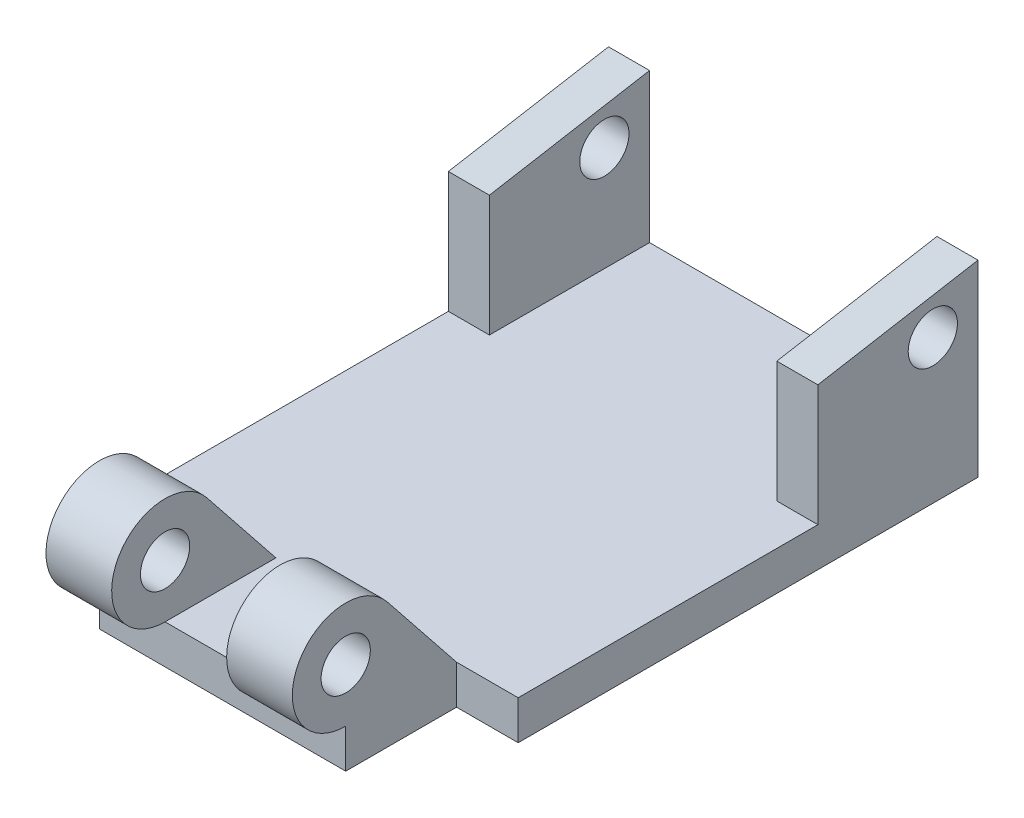
ISO-10303-21;
HEADER;
FILE_DESCRIPTION(('STEP AP214'),'2;1');
FILE_NAME('part.step','',(''),(''),'','','');
FILE_SCHEMA(('AUTOMOTIVE_DESIGN { 1 0 10303 214 1 1 1 1 }'));
ENDSEC;
DATA;
#1=APPLICATION_CONTEXT('core data for automotive mechanical design processes');
#2=APPLICATION_PROTOCOL_DEFINITION('international standard','automotive_design',2000,#1);
#3=PRODUCT_CONTEXT('',#1,'mechanical');
#4=PRODUCT('Part','Part','',(#3));
#5=PRODUCT_RELATED_PRODUCT_CATEGORY('part','',(#4));
#6=PRODUCT_DEFINITION_FORMATION('','',#4);
#7=PRODUCT_DEFINITION_CONTEXT('part definition',#1,'design');
#8=PRODUCT_DEFINITION('design','',#6,#7);
#9=PRODUCT_DEFINITION_SHAPE('','',#8);
#10=(LENGTH_UNIT() NAMED_UNIT(*) SI_UNIT(.MILLI.,.METRE.));
#11=(NAMED_UNIT(*) PLANE_ANGLE_UNIT() SI_UNIT($,.RADIAN.));
#12=(NAMED_UNIT(*) SI_UNIT($,.STERADIAN.) SOLID_ANGLE_UNIT());
#13=UNCERTAINTY_MEASURE_WITH_UNIT(LENGTH_MEASURE(1.E-05),#10,'distance_accuracy_value','');
#14=(GEOMETRIC_REPRESENTATION_CONTEXT(3) GLOBAL_UNCERTAINTY_ASSIGNED_CONTEXT((#13)) GLOBAL_UNIT_ASSIGNED_CONTEXT((#10,
#11,#12)) REPRESENTATION_CONTEXT('',''));
#15=CARTESIAN_POINT('',(0.,0.,0.));
#16=DIRECTION('',(0.,0.,1.));
#17=DIRECTION('',(1.,0.,0.));
#18=AXIS2_PLACEMENT_3D('',#15,#16,#17);
#19=CARTESIAN_POINT('',(0.,6.0325,-71.12));
#20=DIRECTION('',(0.,0.,-1.));
#21=DIRECTION('',(-1.,0.,0.));
#22=AXIS2_PLACEMENT_3D('',#19,#20,#21);
#23=PLANE('',#22);
#24=DIRECTION('',(-1.,0.,0.));
#25=VECTOR('',#24,1.);
#26=CARTESIAN_POINT('',(0.,6.0325,-71.12));
#27=LINE('',#26,#25);
#28=CARTESIAN_POINT('',(50.8,6.0325,-71.12));
#29=VERTEX_POINT('',#28);
#30=CARTESIAN_POINT('',(6.35,6.0325,-71.12));
#31=VERTEX_POINT('',#30);
#32=EDGE_CURVE('E179',#29,#31,#27,.T.);
#33=ORIENTED_EDGE('',*,*,#32,.F.);
#34=DIRECTION('',(0.,1.,0.));
#35=VECTOR('',#34,1.);
#36=CARTESIAN_POINT('',(50.8,0.,-71.12));
#37=LINE('',#36,#35);
#38=CARTESIAN_POINT('',(50.8,29.083,-71.12));
#39=VERTEX_POINT('',#38);
#40=EDGE_CURVE('E176',#29,#39,#37,.T.);
#41=ORIENTED_EDGE('',*,*,#40,.T.);
#42=DIRECTION('',(-1.,0.,0.));
#43=VECTOR('',#42,1.);
#44=CARTESIAN_POINT('',(90.9823923961933,29.083,-71.12));
#45=LINE('',#44,#43);
#46=CARTESIAN_POINT('',(57.15,29.083,-71.12));
#47=VERTEX_POINT('',#46);
#48=EDGE_CURVE('E219',#47,#39,#45,.T.);
#49=ORIENTED_EDGE('',*,*,#48,.F.);
#50=DIRECTION('',(0.,-1.,0.));
#51=VECTOR('',#50,1.);
#52=CARTESIAN_POINT('',(57.15,6.0325,-71.12));
#53=LINE('',#52,#51);
#54=CARTESIAN_POINT('',(57.15,0.,-71.12));
#55=VERTEX_POINT('',#54);
#56=EDGE_CURVE('E354',#47,#55,#53,.T.);
#57=ORIENTED_EDGE('',*,*,#56,.T.);
#58=DIRECTION('',(1.,0.,0.));
#59=VECTOR('',#58,1.);
#60=CARTESIAN_POINT('',(0.,0.,-71.12));
#61=LINE('',#60,#59);
#62=CARTESIAN_POINT('',(0.,0.,-71.12));
#63=VERTEX_POINT('',#62);
#64=EDGE_CURVE('E342',#63,#55,#61,.T.);
#65=ORIENTED_EDGE('',*,*,#64,.F.);
#66=DIRECTION('',(0.,-1.,0.));
#67=VECTOR('',#66,1.);
#68=CARTESIAN_POINT('',(0.,6.0325,-71.12));
#69=LINE('',#68,#67);
#70=CARTESIAN_POINT('',(0.,29.083,-71.12));
#71=VERTEX_POINT('',#70);
#72=EDGE_CURVE('E351',#71,#63,#69,.T.);
#73=ORIENTED_EDGE('',*,*,#72,.F.);
#74=CARTESIAN_POINT('',(6.35000000000001,29.083,-71.12));
#75=VERTEX_POINT('',#74);
#76=EDGE_CURVE('E189',#75,#71,#45,.T.);
#77=ORIENTED_EDGE('',*,*,#76,.F.);
#78=DIRECTION('',(0.,1.,0.));
#79=VECTOR('',#78,1.);
#80=CARTESIAN_POINT('',(6.35,0.,-71.12));
#81=LINE('',#80,#79);
#82=EDGE_CURVE('E59',#31,#75,#81,.T.);
#83=ORIENTED_EDGE('',*,*,#82,.F.);
#84=EDGE_LOOP('',(#33,#41,#49,#57,#65,#73,#77,#83));
#85=FACE_BOUND('',#84,.T.);
#86=ADVANCED_FACE('F41',(#85),#23,.T.);
#87=CARTESIAN_POINT('',(90.9823923961933,6.0325,-46.355));
#88=DIRECTION('',(0.,0.,1.));
#89=DIRECTION('',(1.,0.,0.));
#90=AXIS2_PLACEMENT_3D('',#87,#88,#89);
#91=PLANE('',#90);
#92=DIRECTION('',(-1.,0.,0.));
#93=VECTOR('',#92,1.);
#94=CARTESIAN_POINT('',(90.9823923961933,24.765,-46.355));
#95=LINE('',#94,#93);
#96=CARTESIAN_POINT('',(57.15,24.765,-46.355));
#97=VERTEX_POINT('',#96);
#98=CARTESIAN_POINT('',(50.8,24.765,-46.355));
#99=VERTEX_POINT('',#98);
#100=EDGE_CURVE('E235',#97,#99,#95,.T.);
#101=ORIENTED_EDGE('',*,*,#100,.T.);
#102=DIRECTION('',(0.,-1.,0.));
#103=VECTOR('',#102,1.);
#104=CARTESIAN_POINT('',(50.8,6.0325,-46.355));
#105=LINE('',#104,#103);
#106=CARTESIAN_POINT('',(50.8,6.0325,-46.355));
#107=VERTEX_POINT('',#106);
#108=EDGE_CURVE('E207',#99,#107,#105,.T.);
#109=ORIENTED_EDGE('',*,*,#108,.T.);
#110=DIRECTION('',(-1.,0.,0.));
#111=VECTOR('',#110,1.);
#112=CARTESIAN_POINT('',(90.9823923961933,6.0325,-46.355));
#113=LINE('',#112,#111);
#114=CARTESIAN_POINT('',(57.15,6.0325,-46.355));
#115=VERTEX_POINT('',#114);
#116=EDGE_CURVE('E240',#115,#107,#113,.T.);
#117=ORIENTED_EDGE('',*,*,#116,.F.);
#118=DIRECTION('',(0.,-1.,0.));
#119=VECTOR('',#118,1.);
#120=CARTESIAN_POINT('',(57.15,6.0325,-46.355));
#121=LINE('',#120,#119);
#122=EDGE_CURVE('E212',#97,#115,#121,.T.);
#123=ORIENTED_EDGE('',*,*,#122,.F.);
#124=EDGE_LOOP('',(#101,#109,#117,#123));
#125=FACE_BOUND('',#124,.T.);
#126=ADVANCED_FACE('F391',(#125),#91,.T.);
#127=CARTESIAN_POINT('',(90.9823923961933,24.765,-46.355));
#128=DIRECTION('',(0.,0.985137504933579,0.171767564962778));
#129=DIRECTION('',(0.,-0.171767564962778,0.985137504933579));
#130=AXIS2_PLACEMENT_3D('',#127,#128,#129);
#131=PLANE('',#130);
#132=ORIENTED_EDGE('',*,*,#48,.T.);
#133=DIRECTION('',(0.,-0.171767564962778,0.985137504933579));
#134=VECTOR('',#133,1.);
#135=CARTESIAN_POINT('',(50.8,24.765,-46.355));
#136=LINE('',#135,#134);
#137=EDGE_CURVE('E203',#39,#99,#136,.T.);
#138=ORIENTED_EDGE('',*,*,#137,.T.);
#139=ORIENTED_EDGE('',*,*,#100,.F.);
#140=DIRECTION('',(0.,-0.171767564962778,0.985137504933579));
#141=VECTOR('',#140,1.);
#142=CARTESIAN_POINT('',(57.15,24.765,-46.355));
#143=LINE('',#142,#141);
#144=EDGE_CURVE('E216',#47,#97,#143,.T.);
#145=ORIENTED_EDGE('',*,*,#144,.F.);
#146=EDGE_LOOP('',(#132,#138,#139,#145));
#147=FACE_BOUND('',#146,.T.);
#148=ADVANCED_FACE('F396',(#147),#131,.T.);
#149=CARTESIAN_POINT('',(90.9823923961933,22.225,-64.135));
#150=DIRECTION('',(-1.,0.,0.));
#151=DIRECTION('',(0.,0.,1.));
#152=AXIS2_PLACEMENT_3D('',#149,#150,#151);
#153=CYLINDRICAL_SURFACE('',#152,3.81);
#154=CARTESIAN_POINT('',(57.15,22.225,-64.135));
#155=DIRECTION('',(-1.,0.,0.));
#156=DIRECTION('',(0.,0.,1.));
#157=AXIS2_PLACEMENT_3D('',#154,#155,#156);
#158=CIRCLE('',#157,3.81);
#159=CARTESIAN_POINT('',(57.15,22.225,-60.325));
#160=VERTEX_POINT('',#159);
#161=EDGE_CURVE('E215',#160,#160,#158,.F.);
#162=ORIENTED_EDGE('',*,*,#161,.T.);
#163=EDGE_LOOP('',(#162));
#164=FACE_BOUND('',#163,.T.);
#165=CARTESIAN_POINT('',(50.8,22.225,-64.135));
#166=DIRECTION('',(-1.,0.,0.));
#167=DIRECTION('',(0.,0.,1.));
#168=AXIS2_PLACEMENT_3D('',#165,#166,#167);
#169=CIRCLE('',#168,3.81);
#170=CARTESIAN_POINT('',(50.8,22.225,-60.325));
#171=VERTEX_POINT('',#170);
#172=EDGE_CURVE('E45',#171,#171,#169,.F.);
#173=ORIENTED_EDGE('',*,*,#172,.F.);
#174=EDGE_LOOP('',(#173));
#175=FACE_BOUND('',#174,.T.);
#176=ADVANCED_FACE('F479',(#164,#175),#153,.F.);
#177=CARTESIAN_POINT('',(77.9192255223665,2.34596058551297,-2.94082916255377));
#178=DIRECTION('',(0.,-0.623608017817372,0.78173719376392));
#179=DIRECTION('',(0.,-0.78173719376392,-0.623608017817372));
#180=AXIS2_PLACEMENT_3D('',#177,#178,#179);
#181=PLANE('',#180);
#182=DIRECTION('',(0.,0.78173719376392,0.623608017817372));
#183=VECTOR('',#182,1.);
#184=CARTESIAN_POINT('',(19.685,2.34596058551297,-2.94082916255376));
#185=LINE('',#184,#183);
#186=CARTESIAN_POINT('',(19.685,6.0325,0.));
#187=VERTEX_POINT('',#186);
#188=CARTESIAN_POINT('',(19.685,19.4353841870824,10.6917594654789));
#189=VERTEX_POINT('',#188);
#190=EDGE_CURVE('E264',#187,#189,#185,.T.);
#191=ORIENTED_EDGE('',*,*,#190,.F.);
#192=DIRECTION('',(-1.,0.,0.));
#193=VECTOR('',#192,1.);
#194=CARTESIAN_POINT('',(77.9192255223665,6.0325,0.));
#195=LINE('',#194,#193);
#196=CARTESIAN_POINT('',(9.525,6.0325,0.));
#197=VERTEX_POINT('',#196);
#198=EDGE_CURVE('E268',#187,#197,#195,.T.);
#199=ORIENTED_EDGE('',*,*,#198,.T.);
#200=DIRECTION('',(0.,0.78173719376392,0.623608017817372));
#201=VECTOR('',#200,1.);
#202=CARTESIAN_POINT('',(9.525,2.34596058551297,-2.94082916255376));
#203=LINE('',#202,#201);
#204=CARTESIAN_POINT('',(9.525,19.4353841870824,10.6917594654789));
#205=VERTEX_POINT('',#204);
#206=EDGE_CURVE('E275',#197,#205,#203,.T.);
#207=ORIENTED_EDGE('',*,*,#206,.T.);
#208=DIRECTION('',(-1.,0.,0.));
#209=VECTOR('',#208,1.);
#210=CARTESIAN_POINT('',(77.9192255223665,19.4353841870824,10.6917594654788));
#211=LINE('',#210,#209);
#212=EDGE_CURVE('E292',#189,#205,#211,.T.);
#213=ORIENTED_EDGE('',*,*,#212,.F.);
#214=EDGE_LOOP('',(#191,#199,#207,#213));
#215=FACE_BOUND('',#214,.T.);
#216=ADVANCED_FACE('F481',(#215),#181,.F.);
#217=CARTESIAN_POINT('',(77.9192255223665,14.2875,17.145));
#218=DIRECTION('',(-1.,0.,0.));
#219=DIRECTION('',(0.,0.,1.));
#220=AXIS2_PLACEMENT_3D('',#217,#218,#219);
#221=CYLINDRICAL_SURFACE('',#220,8.255);
#222=DIRECTION('',(1.,0.,0.));
#223=VECTOR('',#222,1.);
#224=CARTESIAN_POINT('',(0.,6.0325,17.145));
#225=LINE('',#224,#223);
#226=CARTESIAN_POINT('',(9.525,6.0325,17.145));
#227=VERTEX_POINT('',#226);
#228=CARTESIAN_POINT('',(19.685,6.0325,17.145));
#229=VERTEX_POINT('',#228);
#230=EDGE_CURVE('E309',#227,#229,#225,.T.);
#231=ORIENTED_EDGE('',*,*,#230,.T.);
#232=CARTESIAN_POINT('',(19.685,14.2875,17.145));
#233=DIRECTION('',(1.,0.,0.));
#234=DIRECTION('',(0.,0.,-1.));
#235=AXIS2_PLACEMENT_3D('',#232,#233,#234);
#236=CIRCLE('',#235,8.255);
#237=EDGE_CURVE('E261',#229,#189,#236,.F.);
#238=ORIENTED_EDGE('',*,*,#237,.T.);
#239=ORIENTED_EDGE('',*,*,#212,.T.);
#240=CARTESIAN_POINT('',(9.525,14.2875,17.145));
#241=DIRECTION('',(-1.,0.,0.));
#242=DIRECTION('',(0.,0.,1.));
#243=AXIS2_PLACEMENT_3D('',#240,#241,#242);
#244=CIRCLE('',#243,8.255);
#245=EDGE_CURVE('E273',#227,#205,#244,.T.);
#246=ORIENTED_EDGE('',*,*,#245,.F.);
#247=EDGE_LOOP('',(#231,#238,#239,#246));
#248=FACE_BOUND('',#247,.T.);
#249=ADVANCED_FACE('F487',(#248),#221,.T.);
#250=CARTESIAN_POINT('',(77.9192255223665,14.2875,17.145));
#251=DIRECTION('',(-1.,0.,0.));
#252=DIRECTION('',(0.,0.,1.));
#253=AXIS2_PLACEMENT_3D('',#250,#251,#252);
#254=CYLINDRICAL_SURFACE('',#253,3.81);
#255=CARTESIAN_POINT('',(9.525,14.2875,17.145));
#256=DIRECTION('',(-1.,0.,0.));
#257=DIRECTION('',(0.,0.,1.));
#258=AXIS2_PLACEMENT_3D('',#255,#256,#257);
#259=CIRCLE('',#258,3.81);
#260=CARTESIAN_POINT('',(9.525,14.2875,20.955));
#261=VERTEX_POINT('',#260);
#262=EDGE_CURVE('E269',#261,#261,#259,.T.);
#263=ORIENTED_EDGE('',*,*,#262,.T.);
#264=EDGE_LOOP('',(#263));
#265=FACE_BOUND('',#264,.T.);
#266=CARTESIAN_POINT('',(19.685,14.2875,17.145));
#267=DIRECTION('',(1.,0.,0.));
#268=DIRECTION('',(0.,0.,-1.));
#269=AXIS2_PLACEMENT_3D('',#266,#267,#268);
#270=CIRCLE('',#269,3.81);
#271=CARTESIAN_POINT('',(19.685,14.2875,13.335));
#272=VERTEX_POINT('',#271);
#273=EDGE_CURVE('E260',#272,#272,#270,.F.);
#274=ORIENTED_EDGE('',*,*,#273,.F.);
#275=EDGE_LOOP('',(#274));
#276=FACE_BOUND('',#275,.T.);
#277=ADVANCED_FACE('F514',(#265,#276),#254,.F.);
#278=CARTESIAN_POINT('',(0.,6.0325,0.));
#279=DIRECTION('',(0.,1.,0.));
#280=DIRECTION('',(0.,0.,1.));
#281=AXIS2_PLACEMENT_3D('',#278,#279,#280);
#282=PLANE('',#281);
#283=ORIENTED_EDGE('',*,*,#116,.T.);
#284=DIRECTION('',(0.,0.,-1.));
#285=VECTOR('',#284,1.);
#286=CARTESIAN_POINT('',(50.8,6.0325,-35.3695));
#287=LINE('',#286,#285);
#288=EDGE_CURVE('E175',#107,#29,#287,.T.);
#289=ORIENTED_EDGE('',*,*,#288,.T.);
#290=ORIENTED_EDGE('',*,*,#32,.T.);
#291=DIRECTION('',(0.,0.,-1.));
#292=VECTOR('',#291,1.);
#293=CARTESIAN_POINT('',(6.35,6.0325,-35.3695));
#294=LINE('',#293,#292);
#295=CARTESIAN_POINT('',(6.35,6.0325,-46.355));
#296=VERTEX_POINT('',#295);
#297=EDGE_CURVE('E167',#296,#31,#294,.T.);
#298=ORIENTED_EDGE('',*,*,#297,.F.);
#299=CARTESIAN_POINT('',(0.,6.0325,-46.355));
#300=VERTEX_POINT('',#299);
#301=EDGE_CURVE('E231',#296,#300,#113,.T.);
#302=ORIENTED_EDGE('',*,*,#301,.T.);
#303=DIRECTION('',(0.,0.,-1.));
#304=VECTOR('',#303,1.);
#305=CARTESIAN_POINT('',(0.,6.0325,0.));
#306=LINE('',#305,#304);
#307=CARTESIAN_POINT('',(0.,6.0325,0.));
#308=VERTEX_POINT('',#307);
#309=EDGE_CURVE('E318',#308,#300,#306,.T.);
#310=ORIENTED_EDGE('',*,*,#309,.F.);
#311=DIRECTION('',(1.,0.,0.));
#312=VECTOR('',#311,1.);
#313=CARTESIAN_POINT('',(0.,6.0325,0.));
#314=LINE('',#313,#312);
#315=EDGE_CURVE('E302',#308,#197,#314,.T.);
#316=ORIENTED_EDGE('',*,*,#315,.T.);
#317=ORIENTED_EDGE('',*,*,#198,.F.);
#318=DIRECTION('',(0.,0.,1.));
#319=VECTOR('',#318,1.);
#320=CARTESIAN_POINT('',(19.685,6.0325,0.));
#321=LINE('',#320,#319);
#322=EDGE_CURVE('E67',#187,#229,#321,.T.);
#323=ORIENTED_EDGE('',*,*,#322,.T.);
#324=CARTESIAN_POINT('',(37.465,6.0325,17.145));
#325=VERTEX_POINT('',#324);
#326=EDGE_CURVE('E313',#229,#325,#225,.T.);
#327=ORIENTED_EDGE('',*,*,#326,.T.);
#328=DIRECTION('',(0.,0.,1.));
#329=VECTOR('',#328,1.);
#330=CARTESIAN_POINT('',(37.465,6.0325,0.));
#331=LINE('',#330,#329);
#332=CARTESIAN_POINT('',(37.465,6.0325,0.));
#333=VERTEX_POINT('',#332);
#334=EDGE_CURVE('E248',#333,#325,#331,.T.);
#335=ORIENTED_EDGE('',*,*,#334,.F.);
#336=CARTESIAN_POINT('',(47.625,6.0325,0.));
#337=VERTEX_POINT('',#336);
#338=EDGE_CURVE('E280',#337,#333,#195,.T.);
#339=ORIENTED_EDGE('',*,*,#338,.F.);
#340=CARTESIAN_POINT('',(57.15,6.0325,0.));
#341=VERTEX_POINT('',#340);
#342=EDGE_CURVE('E308',#337,#341,#314,.T.);
#343=ORIENTED_EDGE('',*,*,#342,.T.);
#344=DIRECTION('',(0.,0.,-1.));
#345=VECTOR('',#344,1.);
#346=CARTESIAN_POINT('',(57.15,6.0325,0.));
#347=LINE('',#346,#345);
#348=EDGE_CURVE('E314',#341,#115,#347,.T.);
#349=ORIENTED_EDGE('',*,*,#348,.T.);
#350=EDGE_LOOP('',(#283,#289,#290,#298,#302,#310,#316,#317,#323,#327,#335,#339,#343,#349));
#351=FACE_BOUND('',#350,.T.);
#352=ADVANCED_FACE('F181',(#351),#282,.T.);
#353=CARTESIAN_POINT('',(0.,6.0325,0.));
#354=DIRECTION('',(0.,0.,-1.));
#355=DIRECTION('',(-1.,0.,0.));
#356=AXIS2_PLACEMENT_3D('',#353,#354,#355);
#357=PLANE('',#356);
#358=DIRECTION('',(1.,0.,0.));
#359=VECTOR('',#358,1.);
#360=CARTESIAN_POINT('',(0.,0.,0.));
#361=LINE('',#360,#359);
#362=CARTESIAN_POINT('',(0.,0.,0.));
#363=VERTEX_POINT('',#362);
#364=CARTESIAN_POINT('',(9.525,0.,0.));
#365=VERTEX_POINT('',#364);
#366=EDGE_CURVE('E295',#363,#365,#361,.T.);
#367=ORIENTED_EDGE('',*,*,#366,.T.);
#368=DIRECTION('',(0.,-1.,0.));
#369=VECTOR('',#368,1.);
#370=CARTESIAN_POINT('',(9.525,6.0325,0.));
#371=LINE('',#370,#369);
#372=EDGE_CURVE('E11',#197,#365,#371,.T.);
#373=ORIENTED_EDGE('',*,*,#372,.F.);
#374=ORIENTED_EDGE('',*,*,#315,.F.);
#375=DIRECTION('',(0.,-1.,0.));
#376=VECTOR('',#375,1.);
#377=CARTESIAN_POINT('',(0.,6.0325,0.));
#378=LINE('',#377,#376);
#379=EDGE_CURVE('E322',#308,#363,#378,.T.);
#380=ORIENTED_EDGE('',*,*,#379,.T.);
#381=EDGE_LOOP('',(#367,#373,#374,#380));
#382=FACE_BOUND('',#381,.T.);
#383=ADVANCED_FACE('F413',(#382),#357,.F.);
#384=CARTESIAN_POINT('',(9.525,6.0325,0.));
#385=DIRECTION('',(1.,0.,0.));
#386=DIRECTION('',(0.,0.,-1.));
#387=AXIS2_PLACEMENT_3D('',#384,#385,#386);
#388=PLANE('',#387);
#389=DIRECTION('',(0.,0.,1.));
#390=VECTOR('',#389,1.);
#391=CARTESIAN_POINT('',(9.525,0.,0.));
#392=LINE('',#391,#390);
#393=CARTESIAN_POINT('',(9.525,0.,17.145));
#394=VERTEX_POINT('',#393);
#395=EDGE_CURVE('E326',#365,#394,#392,.T.);
#396=ORIENTED_EDGE('',*,*,#395,.T.);
#397=DIRECTION('',(0.,-1.,0.));
#398=VECTOR('',#397,1.);
#399=CARTESIAN_POINT('',(9.525,6.0325,17.145));
#400=LINE('',#399,#398);
#401=EDGE_CURVE('E51',#227,#394,#400,.T.);
#402=ORIENTED_EDGE('',*,*,#401,.F.);
#403=ORIENTED_EDGE('',*,*,#245,.T.);
#404=ORIENTED_EDGE('',*,*,#206,.F.);
#405=ORIENTED_EDGE('',*,*,#372,.T.);
#406=EDGE_LOOP('',(#396,#402,#403,#404,#405));
#407=FACE_BOUND('',#406,.T.);
#408=ORIENTED_EDGE('',*,*,#262,.F.);
#409=EDGE_LOOP('',(#408));
#410=FACE_BOUND('',#409,.T.);
#411=ADVANCED_FACE('F43',(#407,#410),#388,.F.);
#412=CARTESIAN_POINT('',(0.,6.0325,17.145));
#413=DIRECTION('',(0.,0.,-1.));
#414=DIRECTION('',(-1.,0.,0.));
#415=AXIS2_PLACEMENT_3D('',#412,#413,#414);
#416=PLANE('',#415);
#417=DIRECTION('',(1.,0.,0.));
#418=VECTOR('',#417,1.);
#419=CARTESIAN_POINT('',(0.,0.,17.145));
#420=LINE('',#419,#418);
#421=CARTESIAN_POINT('',(47.625,0.,17.145));
#422=VERTEX_POINT('',#421);
#423=EDGE_CURVE('E330',#394,#422,#420,.T.);
#424=ORIENTED_EDGE('',*,*,#423,.T.);
#425=DIRECTION('',(0.,-1.,0.));
#426=VECTOR('',#425,1.);
#427=CARTESIAN_POINT('',(47.625,6.0325,17.145));
#428=LINE('',#427,#426);
#429=CARTESIAN_POINT('',(47.625,6.0325,17.145));
#430=VERTEX_POINT('',#429);
#431=EDGE_CURVE('E364',#430,#422,#428,.T.);
#432=ORIENTED_EDGE('',*,*,#431,.F.);
#433=EDGE_CURVE('E306',#325,#430,#225,.T.);
#434=ORIENTED_EDGE('',*,*,#433,.F.);
#435=ORIENTED_EDGE('',*,*,#326,.F.);
#436=ORIENTED_EDGE('',*,*,#230,.F.);
#437=ORIENTED_EDGE('',*,*,#401,.T.);
#438=EDGE_LOOP('',(#424,#432,#434,#435,#436,#437));
#439=FACE_BOUND('',#438,.T.);
#440=ADVANCED_FACE('F415',(#439),#416,.F.);
#441=CARTESIAN_POINT('',(47.625,6.0325,0.));
#442=DIRECTION('',(1.,0.,0.));
#443=DIRECTION('',(0.,0.,-1.));
#444=AXIS2_PLACEMENT_3D('',#441,#442,#443);
#445=PLANE('',#444);
#446=DIRECTION('',(0.,0.,1.));
#447=VECTOR('',#446,1.);
#448=CARTESIAN_POINT('',(47.625,0.,0.));
#449=LINE('',#448,#447);
#450=CARTESIAN_POINT('',(47.625,0.,0.));
#451=VERTEX_POINT('',#450);
#452=EDGE_CURVE('E334',#451,#422,#449,.T.);
#453=ORIENTED_EDGE('',*,*,#452,.F.);
#454=DIRECTION('',(0.,-1.,0.));
#455=VECTOR('',#454,1.);
#456=CARTESIAN_POINT('',(47.625,6.0325,0.));
#457=LINE('',#456,#455);
#458=EDGE_CURVE('E361',#337,#451,#457,.T.);
#459=ORIENTED_EDGE('',*,*,#458,.F.);
#460=DIRECTION('',(0.,0.78173719376392,0.623608017817372));
#461=VECTOR('',#460,1.);
#462=CARTESIAN_POINT('',(47.625,2.34596058551297,-2.94082916255376));
#463=LINE('',#462,#461);
#464=CARTESIAN_POINT('',(47.625,19.4353841870824,10.6917594654788));
#465=VERTEX_POINT('',#464);
#466=EDGE_CURVE('E288',#337,#465,#463,.T.);
#467=ORIENTED_EDGE('',*,*,#466,.T.);
#468=CARTESIAN_POINT('',(47.625,14.2875,17.145));
#469=DIRECTION('',(1.,0.,0.));
#470=DIRECTION('',(0.,0.,-1.));
#471=AXIS2_PLACEMENT_3D('',#468,#469,#470);
#472=CIRCLE('',#471,8.255);
#473=EDGE_CURVE('E279',#430,#465,#472,.F.);
#474=ORIENTED_EDGE('',*,*,#473,.F.);
#475=ORIENTED_EDGE('',*,*,#431,.T.);
#476=EDGE_LOOP('',(#453,#459,#467,#474,#475));
#477=FACE_BOUND('',#476,.T.);
#478=CARTESIAN_POINT('',(47.625,14.2875,17.145));
#479=DIRECTION('',(1.,0.,0.));
#480=DIRECTION('',(0.,0.,-1.));
#481=AXIS2_PLACEMENT_3D('',#478,#479,#480);
#482=CIRCLE('',#481,3.81);
#483=CARTESIAN_POINT('',(47.625,14.2875,13.335));
#484=VERTEX_POINT('',#483);
#485=EDGE_CURVE('E284',#484,#484,#482,.F.);
#486=ORIENTED_EDGE('',*,*,#485,.T.);
#487=EDGE_LOOP('',(#486));
#488=FACE_BOUND('',#487,.T.);
#489=ADVANCED_FACE('F411',(#477,#488),#445,.T.);
#490=CARTESIAN_POINT('',(57.15,0.,0.));
#491=VERTEX_POINT('',#490);
#492=EDGE_CURVE('E327',#451,#491,#361,.T.);
#493=ORIENTED_EDGE('',*,*,#492,.T.);
#494=DIRECTION('',(0.,-1.,0.));
#495=VECTOR('',#494,1.);
#496=CARTESIAN_POINT('',(57.15,6.0325,0.));
#497=LINE('',#496,#495);
#498=EDGE_CURVE('E357',#341,#491,#497,.T.);
#499=ORIENTED_EDGE('',*,*,#498,.F.);
#500=ORIENTED_EDGE('',*,*,#342,.F.);
#501=ORIENTED_EDGE('',*,*,#458,.T.);
#502=EDGE_LOOP('',(#493,#499,#500,#501));
#503=FACE_BOUND('',#502,.T.);
#504=ADVANCED_FACE('F407',(#503),#357,.F.);
#505=CARTESIAN_POINT('',(57.15,6.0325,0.));
#506=DIRECTION('',(-1.,0.,0.));
#507=DIRECTION('',(0.,0.,1.));
#508=AXIS2_PLACEMENT_3D('',#505,#506,#507);
#509=PLANE('',#508);
#510=DIRECTION('',(0.,0.,-1.));
#511=VECTOR('',#510,1.);
#512=CARTESIAN_POINT('',(57.15,0.,0.));
#513=LINE('',#512,#511);
#514=EDGE_CURVE('E338',#491,#55,#513,.T.);
#515=ORIENTED_EDGE('',*,*,#514,.T.);
#516=ORIENTED_EDGE('',*,*,#56,.F.);
#517=ORIENTED_EDGE('',*,*,#144,.T.);
#518=ORIENTED_EDGE('',*,*,#122,.T.);
#519=ORIENTED_EDGE('',*,*,#348,.F.);
#520=ORIENTED_EDGE('',*,*,#498,.T.);
#521=EDGE_LOOP('',(#515,#516,#517,#518,#519,#520));
#522=FACE_BOUND('',#521,.T.);
#523=ORIENTED_EDGE('',*,*,#161,.F.);
#524=EDGE_LOOP('',(#523));
#525=FACE_BOUND('',#524,.T.);
#526=ADVANCED_FACE('F404',(#522,#525),#509,.F.);
#527=CARTESIAN_POINT('',(0.,6.0325,0.));
#528=DIRECTION('',(-1.,0.,0.));
#529=DIRECTION('',(0.,0.,1.));
#530=AXIS2_PLACEMENT_3D('',#527,#528,#529);
#531=PLANE('',#530);
#532=DIRECTION('',(0.,0.,-1.));
#533=VECTOR('',#532,1.);
#534=CARTESIAN_POINT('',(0.,0.,0.));
#535=LINE('',#534,#533);
#536=EDGE_CURVE('E307',#363,#63,#535,.T.);
#537=ORIENTED_EDGE('',*,*,#536,.F.);
#538=ORIENTED_EDGE('',*,*,#379,.F.);
#539=ORIENTED_EDGE('',*,*,#309,.T.);
#540=DIRECTION('',(0.,1.,0.));
#541=VECTOR('',#540,1.);
#542=CARTESIAN_POINT('',(0.,6.0325,-46.355));
#543=LINE('',#542,#541);
#544=CARTESIAN_POINT('',(0.,24.765,-46.355));
#545=VERTEX_POINT('',#544);
#546=EDGE_CURVE('E223',#300,#545,#543,.T.);
#547=ORIENTED_EDGE('',*,*,#546,.T.);
#548=DIRECTION('',(0.,0.171767564962778,-0.985137504933579));
#549=VECTOR('',#548,1.);
#550=CARTESIAN_POINT('',(0.,24.765,-46.355));
#551=LINE('',#550,#549);
#552=EDGE_CURVE('E227',#545,#71,#551,.T.);
#553=ORIENTED_EDGE('',*,*,#552,.T.);
#554=ORIENTED_EDGE('',*,*,#72,.T.);
#555=EDGE_LOOP('',(#537,#538,#539,#547,#553,#554));
#556=FACE_BOUND('',#555,.T.);
#557=CARTESIAN_POINT('',(0.,22.225,-64.135));
#558=DIRECTION('',(-1.,0.,0.));
#559=DIRECTION('',(0.,0.,1.));
#560=AXIS2_PLACEMENT_3D('',#557,#558,#559);
#561=CIRCLE('',#560,3.81);
#562=CARTESIAN_POINT('',(0.,22.225,-60.325));
#563=VERTEX_POINT('',#562);
#564=EDGE_CURVE('E211',#563,#563,#561,.T.);
#565=ORIENTED_EDGE('',*,*,#564,.F.);
#566=EDGE_LOOP('',(#565));
#567=FACE_BOUND('',#566,.T.);
#568=ADVANCED_FACE('F402',(#556,#567),#531,.T.);
#569=CARTESIAN_POINT('',(0.,0.,0.));
#570=DIRECTION('',(0.,1.,0.));
#571=DIRECTION('',(0.,0.,1.));
#572=AXIS2_PLACEMENT_3D('',#569,#570,#571);
#573=PLANE('',#572);
#574=ORIENTED_EDGE('',*,*,#366,.F.);
#575=ORIENTED_EDGE('',*,*,#536,.T.);
#576=ORIENTED_EDGE('',*,*,#64,.T.);
#577=ORIENTED_EDGE('',*,*,#514,.F.);
#578=ORIENTED_EDGE('',*,*,#492,.F.);
#579=ORIENTED_EDGE('',*,*,#452,.T.);
#580=ORIENTED_EDGE('',*,*,#423,.F.);
#581=ORIENTED_EDGE('',*,*,#395,.F.);
#582=EDGE_LOOP('',(#574,#575,#576,#577,#578,#579,#580,#581));
#583=FACE_BOUND('',#582,.T.);
#584=ADVANCED_FACE('F432',(#583),#573,.F.);
#585=ORIENTED_EDGE('',*,*,#338,.T.);
#586=DIRECTION('',(0.,0.78173719376392,0.623608017817372));
#587=VECTOR('',#586,1.);
#588=CARTESIAN_POINT('',(37.465,2.34596058551297,-2.94082916255376));
#589=LINE('',#588,#587);
#590=CARTESIAN_POINT('',(37.465,19.4353841870824,10.6917594654788));
#591=VERTEX_POINT('',#590);
#592=EDGE_CURVE('E256',#333,#591,#589,.T.);
#593=ORIENTED_EDGE('',*,*,#592,.T.);
#594=EDGE_CURVE('E274',#465,#591,#211,.T.);
#595=ORIENTED_EDGE('',*,*,#594,.F.);
#596=ORIENTED_EDGE('',*,*,#466,.F.);
#597=EDGE_LOOP('',(#585,#593,#595,#596));
#598=FACE_BOUND('',#597,.T.);
#599=ADVANCED_FACE('F450',(#598),#181,.F.);
#600=CARTESIAN_POINT('',(37.465,14.2875,17.145));
#601=DIRECTION('',(1.,0.,0.));
#602=DIRECTION('',(0.,0.,-1.));
#603=AXIS2_PLACEMENT_3D('',#600,#601,#602);
#604=CIRCLE('',#603,8.255);
#605=EDGE_CURVE('E253',#325,#591,#604,.F.);
#606=ORIENTED_EDGE('',*,*,#605,.F.);
#607=ORIENTED_EDGE('',*,*,#433,.T.);
#608=ORIENTED_EDGE('',*,*,#473,.T.);
#609=ORIENTED_EDGE('',*,*,#594,.T.);
#610=EDGE_LOOP('',(#606,#607,#608,#609));
#611=FACE_BOUND('',#610,.T.);
#612=ADVANCED_FACE('F441',(#611),#221,.T.);
#613=CARTESIAN_POINT('',(37.465,14.2875,17.145));
#614=DIRECTION('',(1.,0.,0.));
#615=DIRECTION('',(0.,0.,-1.));
#616=AXIS2_PLACEMENT_3D('',#613,#614,#615);
#617=CIRCLE('',#616,3.81);
#618=CARTESIAN_POINT('',(37.465,14.2875,13.335));
#619=VERTEX_POINT('',#618);
#620=EDGE_CURVE('E252',#619,#619,#617,.F.);
#621=ORIENTED_EDGE('',*,*,#620,.T.);
#622=EDGE_LOOP('',(#621));
#623=FACE_BOUND('',#622,.T.);
#624=ORIENTED_EDGE('',*,*,#485,.F.);
#625=EDGE_LOOP('',(#624));
#626=FACE_BOUND('',#625,.T.);
#627=ADVANCED_FACE('F506',(#623,#626),#254,.F.);
#628=CARTESIAN_POINT('',(19.685,41.783,0.));
#629=DIRECTION('',(1.,0.,0.));
#630=DIRECTION('',(0.,0.,-1.));
#631=AXIS2_PLACEMENT_3D('',#628,#629,#630);
#632=PLANE('',#631);
#633=ORIENTED_EDGE('',*,*,#273,.T.);
#634=EDGE_LOOP('',(#633));
#635=FACE_BOUND('',#634,.T.);
#636=ORIENTED_EDGE('',*,*,#190,.T.);
#637=ORIENTED_EDGE('',*,*,#237,.F.);
#638=ORIENTED_EDGE('',*,*,#322,.F.);
#639=EDGE_LOOP('',(#636,#637,#638));
#640=FACE_BOUND('',#639,.T.);
#641=ADVANCED_FACE('F502',(#635,#640),#632,.T.);
#642=CARTESIAN_POINT('',(37.465,41.783,0.));
#643=DIRECTION('',(1.,0.,0.));
#644=DIRECTION('',(0.,0.,-1.));
#645=AXIS2_PLACEMENT_3D('',#642,#643,#644);
#646=PLANE('',#645);
#647=ORIENTED_EDGE('',*,*,#620,.F.);
#648=EDGE_LOOP('',(#647));
#649=FACE_BOUND('',#648,.T.);
#650=ORIENTED_EDGE('',*,*,#334,.T.);
#651=ORIENTED_EDGE('',*,*,#605,.T.);
#652=ORIENTED_EDGE('',*,*,#592,.F.);
#653=EDGE_LOOP('',(#650,#651,#652));
#654=FACE_BOUND('',#653,.T.);
#655=ADVANCED_FACE('F448',(#649,#654),#646,.F.);
#656=DIRECTION('',(0.,-1.,0.));
#657=VECTOR('',#656,1.);
#658=CARTESIAN_POINT('',(6.34999999999999,6.03250000000001,-46.355));
#659=LINE('',#658,#657);
#660=CARTESIAN_POINT('',(6.34999999999999,24.765,-46.355));
#661=VERTEX_POINT('',#660);
#662=EDGE_CURVE('E172',#661,#296,#659,.T.);
#663=ORIENTED_EDGE('',*,*,#662,.F.);
#664=EDGE_CURVE('E239',#661,#545,#95,.T.);
#665=ORIENTED_EDGE('',*,*,#664,.T.);
#666=ORIENTED_EDGE('',*,*,#546,.F.);
#667=ORIENTED_EDGE('',*,*,#301,.F.);
#668=EDGE_LOOP('',(#663,#665,#666,#667));
#669=FACE_BOUND('',#668,.T.);
#670=ADVANCED_FACE('F399',(#669),#91,.T.);
#671=DIRECTION('',(0.,-0.171767564962778,0.985137504933579));
#672=VECTOR('',#671,1.);
#673=CARTESIAN_POINT('',(6.34999999999999,24.765,-46.355));
#674=LINE('',#673,#672);
#675=EDGE_CURVE('E198',#75,#661,#674,.T.);
#676=ORIENTED_EDGE('',*,*,#675,.F.);
#677=ORIENTED_EDGE('',*,*,#76,.T.);
#678=ORIENTED_EDGE('',*,*,#552,.F.);
#679=ORIENTED_EDGE('',*,*,#664,.F.);
#680=EDGE_LOOP('',(#676,#677,#678,#679));
#681=FACE_BOUND('',#680,.T.);
#682=ADVANCED_FACE('F471',(#681),#131,.T.);
#683=CARTESIAN_POINT('',(6.34999999999999,22.225,-64.135));
#684=DIRECTION('',(-1.,0.,0.));
#685=DIRECTION('',(0.,-1.,0.));
#686=AXIS2_PLACEMENT_3D('',#683,#684,#685);
#687=CIRCLE('',#686,3.81);
#688=CARTESIAN_POINT('',(6.34999999999999,18.415,-64.135));
#689=VERTEX_POINT('',#688);
#690=EDGE_CURVE('E196',#689,#689,#687,.F.);
#691=ORIENTED_EDGE('',*,*,#690,.T.);
#692=EDGE_LOOP('',(#691));
#693=FACE_BOUND('',#692,.T.);
#694=ORIENTED_EDGE('',*,*,#564,.T.);
#695=EDGE_LOOP('',(#694));
#696=FACE_BOUND('',#695,.T.);
#697=ADVANCED_FACE('F379',(#693,#696),#153,.F.);
#698=CARTESIAN_POINT('',(50.8,0.,-35.3695));
#699=DIRECTION('',(-1.,0.,0.));
#700=DIRECTION('',(0.,0.,1.));
#701=AXIS2_PLACEMENT_3D('',#698,#699,#700);
#702=PLANE('',#701);
#703=ORIENTED_EDGE('',*,*,#137,.F.);
#704=ORIENTED_EDGE('',*,*,#40,.F.);
#705=ORIENTED_EDGE('',*,*,#288,.F.);
#706=ORIENTED_EDGE('',*,*,#108,.F.);
#707=EDGE_LOOP('',(#703,#704,#705,#706));
#708=FACE_BOUND('',#707,.T.);
#709=ORIENTED_EDGE('',*,*,#172,.T.);
#710=EDGE_LOOP('',(#709));
#711=FACE_BOUND('',#710,.T.);
#712=ADVANCED_FACE('F382',(#708,#711),#702,.T.);
#713=CARTESIAN_POINT('',(6.35,0.,-35.3695));
#714=DIRECTION('',(-1.,0.,0.));
#715=DIRECTION('',(0.,-1.,0.));
#716=AXIS2_PLACEMENT_3D('',#713,#714,#715);
#717=PLANE('',#716);
#718=ORIENTED_EDGE('',*,*,#662,.T.);
#719=ORIENTED_EDGE('',*,*,#297,.T.);
#720=ORIENTED_EDGE('',*,*,#82,.T.);
#721=ORIENTED_EDGE('',*,*,#675,.T.);
#722=EDGE_LOOP('',(#718,#719,#720,#721));
#723=FACE_BOUND('',#722,.T.);
#724=ORIENTED_EDGE('',*,*,#690,.F.);
#725=EDGE_LOOP('',(#724));
#726=FACE_BOUND('',#725,.T.);
#727=ADVANCED_FACE('F169',(#723,#726),#717,.F.);
#728=CLOSED_SHELL('',(#86,#126,#148,#176,#216,#249,#277,#352,#383,#411,#440,#489,#504,#526,#568,
#584,#599,#612,#627,#641,#655,#670,#682,#697,#712,#727));
#729=MANIFOLD_SOLID_BREP('B2',#728);
#730=ADVANCED_BREP_SHAPE_REPRESENTATION('',(#18,#729),#14);
#731=SHAPE_DEFINITION_REPRESENTATION(#9,#730);
ENDSEC;
END-ISO-10303-21;
